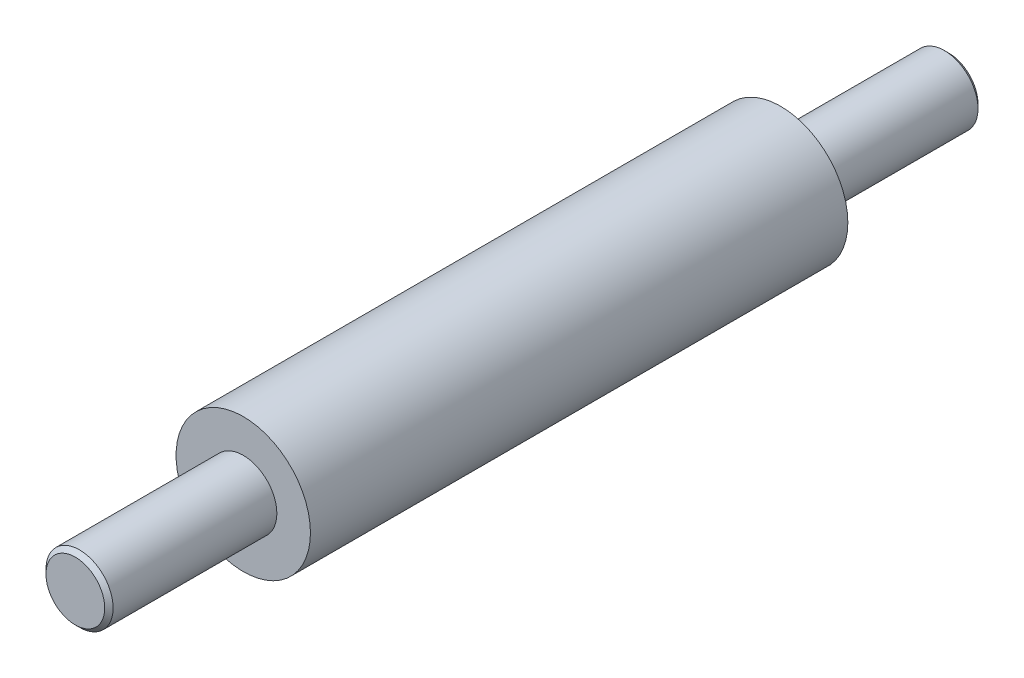
ISO-10303-21;
HEADER;
FILE_DESCRIPTION(('STEP AP214'),'2;1');
FILE_NAME('part.step','',(''),(''),'','','');
FILE_SCHEMA(('AUTOMOTIVE_DESIGN { 1 0 10303 214 1 1 1 1 }'));
ENDSEC;
DATA;
#1=APPLICATION_CONTEXT('core data for automotive mechanical design processes');
#2=APPLICATION_PROTOCOL_DEFINITION('international standard','automotive_design',2000,#1);
#3=PRODUCT_CONTEXT('',#1,'mechanical');
#4=PRODUCT('Part','Part','',(#3));
#5=PRODUCT_RELATED_PRODUCT_CATEGORY('part','',(#4));
#6=PRODUCT_DEFINITION_FORMATION('','',#4);
#7=PRODUCT_DEFINITION_CONTEXT('part definition',#1,'design');
#8=PRODUCT_DEFINITION('design','',#6,#7);
#9=PRODUCT_DEFINITION_SHAPE('','',#8);
#10=(LENGTH_UNIT() NAMED_UNIT(*) SI_UNIT(.MILLI.,.METRE.));
#11=(NAMED_UNIT(*) PLANE_ANGLE_UNIT() SI_UNIT($,.RADIAN.));
#12=(NAMED_UNIT(*) SI_UNIT($,.STERADIAN.) SOLID_ANGLE_UNIT());
#13=UNCERTAINTY_MEASURE_WITH_UNIT(LENGTH_MEASURE(1.E-05),#10,'distance_accuracy_value','');
#14=(GEOMETRIC_REPRESENTATION_CONTEXT(3) GLOBAL_UNCERTAINTY_ASSIGNED_CONTEXT((#13)) GLOBAL_UNIT_ASSIGNED_CONTEXT((#10,
#11,#12)) REPRESENTATION_CONTEXT('',''));
#15=CARTESIAN_POINT('',(0.,0.,0.));
#16=DIRECTION('',(0.,0.,1.));
#17=DIRECTION('',(1.,0.,0.));
#18=AXIS2_PLACEMENT_3D('',#15,#16,#17);
#19=CARTESIAN_POINT('',(0.,0.,16.));
#20=DIRECTION('',(0.,0.,-1.));
#21=DIRECTION('',(-1.,0.,0.));
#22=AXIS2_PLACEMENT_3D('',#19,#20,#21);
#23=CYLINDRICAL_SURFACE('',#22,4.);
#24=CARTESIAN_POINT('',(0.,0.,16.));
#25=DIRECTION('',(0.,0.,1.));
#26=DIRECTION('',(1.,0.,0.));
#27=AXIS2_PLACEMENT_3D('',#24,#25,#26);
#28=CIRCLE('',#27,4.);
#29=CARTESIAN_POINT('',(4.,0.,16.));
#30=VERTEX_POINT('',#29);
#31=EDGE_CURVE('E50',#30,#30,#28,.T.);
#32=ORIENTED_EDGE('',*,*,#31,.F.);
#33=EDGE_LOOP('',(#32));
#34=FACE_BOUND('',#33,.T.);
#35=CARTESIAN_POINT('',(0.,0.,-16.));
#36=DIRECTION('',(0.,0.,1.));
#37=DIRECTION('',(1.,0.,0.));
#38=AXIS2_PLACEMENT_3D('',#35,#36,#37);
#39=CIRCLE('',#38,4.);
#40=CARTESIAN_POINT('',(4.,0.,-16.));
#41=VERTEX_POINT('',#40);
#42=EDGE_CURVE('E53',#41,#41,#39,.T.);
#43=ORIENTED_EDGE('',*,*,#42,.T.);
#44=EDGE_LOOP('',(#43));
#45=FACE_BOUND('',#44,.T.);
#46=ADVANCED_FACE('F35',(#34,#45),#23,.T.);
#47=CARTESIAN_POINT('',(0.,0.,16.));
#48=DIRECTION('',(0.,0.,1.));
#49=DIRECTION('',(1.,0.,0.));
#50=AXIS2_PLACEMENT_3D('',#47,#48,#49);
#51=PLANE('',#50);
#52=CARTESIAN_POINT('',(0.,0.,16.));
#53=DIRECTION('',(0.,0.,1.));
#54=DIRECTION('',(1.,0.,0.));
#55=AXIS2_PLACEMENT_3D('',#52,#53,#54);
#56=CIRCLE('',#55,2.);
#57=CARTESIAN_POINT('',(2.,0.,16.));
#58=VERTEX_POINT('',#57);
#59=EDGE_CURVE('E56',#58,#58,#56,.T.);
#60=ORIENTED_EDGE('',*,*,#59,.F.);
#61=EDGE_LOOP('',(#60));
#62=FACE_BOUND('',#61,.T.);
#63=ORIENTED_EDGE('',*,*,#31,.T.);
#64=EDGE_LOOP('',(#63));
#65=FACE_BOUND('',#64,.T.);
#66=ADVANCED_FACE('F85',(#62,#65),#51,.T.);
#67=CARTESIAN_POINT('',(0.,0.,-16.));
#68=DIRECTION('',(0.,0.,1.));
#69=DIRECTION('',(1.,0.,0.));
#70=AXIS2_PLACEMENT_3D('',#67,#68,#69);
#71=PLANE('',#70);
#72=CARTESIAN_POINT('',(0.,0.,-16.));
#73=DIRECTION('',(0.,0.,1.));
#74=DIRECTION('',(1.,0.,0.));
#75=AXIS2_PLACEMENT_3D('',#72,#73,#74);
#76=CIRCLE('',#75,2.);
#77=CARTESIAN_POINT('',(2.,0.,-16.));
#78=VERTEX_POINT('',#77);
#79=EDGE_CURVE('E10',#78,#78,#76,.F.);
#80=ORIENTED_EDGE('',*,*,#79,.F.);
#81=EDGE_LOOP('',(#80));
#82=FACE_BOUND('',#81,.T.);
#83=ORIENTED_EDGE('',*,*,#42,.F.);
#84=EDGE_LOOP('',(#83));
#85=FACE_BOUND('',#84,.T.);
#86=ADVANCED_FACE('F90',(#82,#85),#71,.F.);
#87=CARTESIAN_POINT('',(0.,0.,26.));
#88=DIRECTION('',(0.,0.,-1.));
#89=DIRECTION('',(-1.,0.,0.));
#90=AXIS2_PLACEMENT_3D('',#87,#88,#89);
#91=CYLINDRICAL_SURFACE('',#90,2.);
#92=CARTESIAN_POINT('',(0.,0.,25.75));
#93=DIRECTION('',(0.,0.,1.));
#94=DIRECTION('',(1.,0.,0.));
#95=AXIS2_PLACEMENT_3D('',#92,#93,#94);
#96=CIRCLE('',#95,2.);
#97=CARTESIAN_POINT('',(2.,0.,25.75));
#98=VERTEX_POINT('',#97);
#99=EDGE_CURVE('E42',#98,#98,#96,.F.);
#100=ORIENTED_EDGE('',*,*,#99,.T.);
#101=EDGE_LOOP('',(#100));
#102=FACE_BOUND('',#101,.T.);
#103=ORIENTED_EDGE('',*,*,#59,.T.);
#104=EDGE_LOOP('',(#103));
#105=FACE_BOUND('',#104,.T.);
#106=ADVANCED_FACE('F97',(#102,#105),#91,.T.);
#107=CARTESIAN_POINT('',(0.,0.,26.));
#108=DIRECTION('',(0.,0.,1.));
#109=DIRECTION('',(1.,0.,0.));
#110=AXIS2_PLACEMENT_3D('',#107,#108,#109);
#111=PLANE('',#110);
#112=CARTESIAN_POINT('',(0.,0.,26.));
#113=DIRECTION('',(0.,0.,1.));
#114=DIRECTION('',(1.,0.,0.));
#115=AXIS2_PLACEMENT_3D('',#112,#113,#114);
#116=CIRCLE('',#115,1.75000000000001);
#117=CARTESIAN_POINT('',(1.75000000000001,0.,26.));
#118=VERTEX_POINT('',#117);
#119=EDGE_CURVE('E46',#118,#118,#116,.T.);
#120=ORIENTED_EDGE('',*,*,#119,.T.);
#121=EDGE_LOOP('',(#120));
#122=FACE_BOUND('',#121,.T.);
#123=ADVANCED_FACE('F81',(#122),#111,.T.);
#124=CARTESIAN_POINT('',(0.,0.,26.));
#125=DIRECTION('',(0.,0.,-1.));
#126=DIRECTION('',(-1.,0.,0.));
#127=AXIS2_PLACEMENT_3D('',#124,#125,#126);
#128=CONICAL_SURFACE('',#127,1.75000000000001,0.785398163397438);
#129=ORIENTED_EDGE('',*,*,#99,.F.);
#130=EDGE_LOOP('',(#129));
#131=FACE_BOUND('',#130,.T.);
#132=ORIENTED_EDGE('',*,*,#119,.F.);
#133=EDGE_LOOP('',(#132));
#134=FACE_BOUND('',#133,.T.);
#135=ADVANCED_FACE('F37',(#131,#134),#128,.T.);
#136=CARTESIAN_POINT('',(0.,0.,-26.));
#137=DIRECTION('',(0.,0.,1.));
#138=DIRECTION('',(-1.,0.,0.));
#139=AXIS2_PLACEMENT_3D('',#136,#137,#138);
#140=CYLINDRICAL_SURFACE('',#139,2.);
#141=CARTESIAN_POINT('',(0.,0.,-25.75));
#142=DIRECTION('',(0.,0.,1.));
#143=DIRECTION('',(1.,0.,0.));
#144=AXIS2_PLACEMENT_3D('',#141,#142,#143);
#145=CIRCLE('',#144,2.);
#146=CARTESIAN_POINT('',(2.,0.,-25.75));
#147=VERTEX_POINT('',#146);
#148=EDGE_CURVE('E64',#147,#147,#145,.F.);
#149=ORIENTED_EDGE('',*,*,#148,.F.);
#150=EDGE_LOOP('',(#149));
#151=FACE_BOUND('',#150,.T.);
#152=ORIENTED_EDGE('',*,*,#79,.T.);
#153=EDGE_LOOP('',(#152));
#154=FACE_BOUND('',#153,.T.);
#155=ADVANCED_FACE('F71',(#151,#154),#140,.T.);
#156=CARTESIAN_POINT('',(0.,0.,-26.));
#157=DIRECTION('',(0.,0.,-1.));
#158=DIRECTION('',(1.,0.,0.));
#159=AXIS2_PLACEMENT_3D('',#156,#157,#158);
#160=PLANE('',#159);
#161=CARTESIAN_POINT('',(0.,0.,-26.));
#162=DIRECTION('',(0.,0.,1.));
#163=DIRECTION('',(1.,0.,0.));
#164=AXIS2_PLACEMENT_3D('',#161,#162,#163);
#165=CIRCLE('',#164,1.75000000000001);
#166=CARTESIAN_POINT('',(1.75000000000001,0.,-26.));
#167=VERTEX_POINT('',#166);
#168=EDGE_CURVE('E61',#167,#167,#165,.T.);
#169=ORIENTED_EDGE('',*,*,#168,.F.);
#170=EDGE_LOOP('',(#169));
#171=FACE_BOUND('',#170,.T.);
#172=ADVANCED_FACE('F73',(#171),#160,.T.);
#173=CARTESIAN_POINT('',(0.,0.,-26.));
#174=DIRECTION('',(0.,0.,1.));
#175=DIRECTION('',(-1.,0.,0.));
#176=AXIS2_PLACEMENT_3D('',#173,#174,#175);
#177=CONICAL_SURFACE('',#176,1.75000000000001,0.785398163397438);
#178=ORIENTED_EDGE('',*,*,#148,.T.);
#179=EDGE_LOOP('',(#178));
#180=FACE_BOUND('',#179,.T.);
#181=ORIENTED_EDGE('',*,*,#168,.T.);
#182=EDGE_LOOP('',(#181));
#183=FACE_BOUND('',#182,.T.);
#184=ADVANCED_FACE('F68',(#180,#183),#177,.T.);
#185=CLOSED_SHELL('',(#46,#66,#86,#106,#123,#135,#155,#172,#184));
#186=MANIFOLD_SOLID_BREP('B2',#185);
#187=ADVANCED_BREP_SHAPE_REPRESENTATION('',(#18,#186),#14);
#188=SHAPE_DEFINITION_REPRESENTATION(#9,#187);
ENDSEC;
END-ISO-10303-21;
